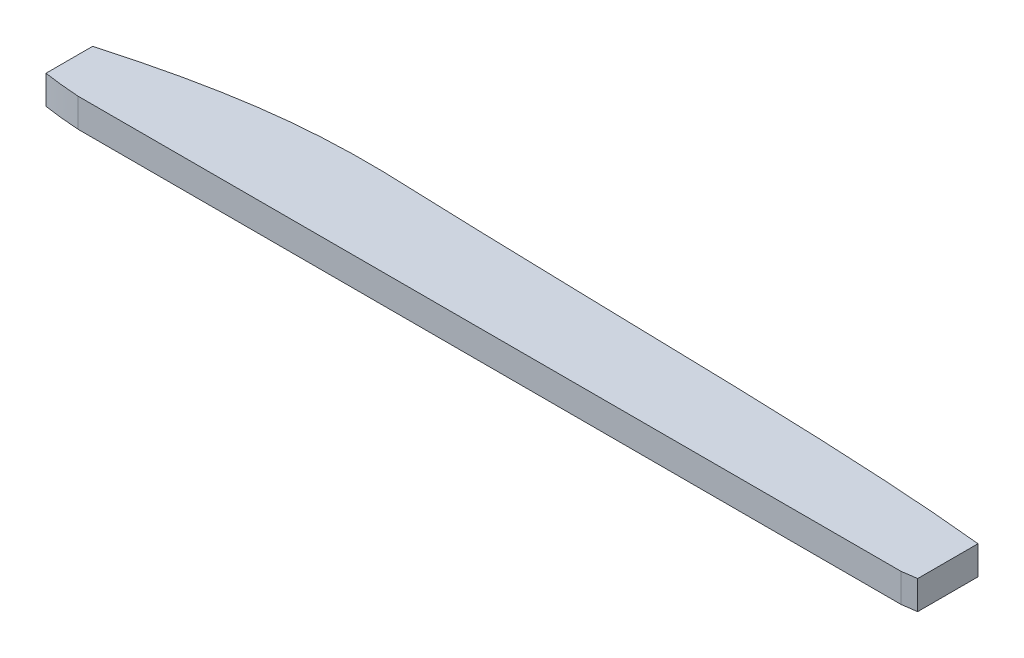
ISO-10303-21;
HEADER;
FILE_DESCRIPTION(('STEP AP214'),'2;1');
FILE_NAME('part.step','',(''),(''),'','','');
FILE_SCHEMA(('AUTOMOTIVE_DESIGN { 1 0 10303 214 1 1 1 1 }'));
ENDSEC;
DATA;
#1=APPLICATION_CONTEXT('core data for automotive mechanical design processes');
#2=APPLICATION_PROTOCOL_DEFINITION('international standard','automotive_design',2000,#1);
#3=PRODUCT_CONTEXT('',#1,'mechanical');
#4=PRODUCT('Part','Part','',(#3));
#5=PRODUCT_RELATED_PRODUCT_CATEGORY('part','',(#4));
#6=PRODUCT_DEFINITION_FORMATION('','',#4);
#7=PRODUCT_DEFINITION_CONTEXT('part definition',#1,'design');
#8=PRODUCT_DEFINITION('design','',#6,#7);
#9=PRODUCT_DEFINITION_SHAPE('','',#8);
#10=(LENGTH_UNIT() NAMED_UNIT(*) SI_UNIT(.MILLI.,.METRE.));
#11=(NAMED_UNIT(*) PLANE_ANGLE_UNIT() SI_UNIT($,.RADIAN.));
#12=(NAMED_UNIT(*) SI_UNIT($,.STERADIAN.) SOLID_ANGLE_UNIT());
#13=UNCERTAINTY_MEASURE_WITH_UNIT(LENGTH_MEASURE(1.E-05),#10,'distance_accuracy_value','');
#14=(GEOMETRIC_REPRESENTATION_CONTEXT(3) GLOBAL_UNCERTAINTY_ASSIGNED_CONTEXT((#13)) GLOBAL_UNIT_ASSIGNED_CONTEXT((#10,
#11,#12)) REPRESENTATION_CONTEXT('',''));
#15=CARTESIAN_POINT('',(0.,0.,0.));
#16=DIRECTION('',(0.,0.,1.));
#17=DIRECTION('',(1.,0.,0.));
#18=AXIS2_PLACEMENT_3D('',#15,#16,#17);
#19=CARTESIAN_POINT('',(-255.236633658495,2.921,-72.2823917229411));
#20=DIRECTION('',(0.,1.,0.));
#21=DIRECTION('',(0.,0.,1.));
#22=AXIS2_PLACEMENT_3D('',#19,#20,#21);
#23=PLANE('',#22);
#24=CARTESIAN_POINT('',(-215.715924488122,2.921,-70.4604921100144));
#25=CARTESIAN_POINT('',(-231.799642529937,2.921,-72.1495505666028));
#26=CARTESIAN_POINT('',(-256.470441338529,2.921,-72.0212095813652));
#27=CARTESIAN_POINT('',(-284.451069938425,2.921,-73.2862511205198));
#28=CARTESIAN_POINT('',(-294.871993266632,2.921,-72.023916826068));
#29=CARTESIAN_POINT('',(-304.615924488122,2.921,-69.2428463332284));
#30=B_SPLINE_CURVE_WITH_KNOTS('',3,(#24,#25,#26,#27,#28,#29),.UNSPECIFIED.,.F.,.F.,(4,1,1,4),
(0.0333418760915517,0.663885735792262,0.752110336507284,0.915587883241767),.UNSPECIFIED.);
#31=CARTESIAN_POINT('',(-215.715924488122,2.921,-70.4604921100144));
#32=VERTEX_POINT('',#31);
#33=CARTESIAN_POINT('',(-304.615924488122,2.921,-69.2428463332284));
#34=VERTEX_POINT('',#33);
#35=EDGE_CURVE('E13',#32,#34,#30,.T.);
#36=ORIENTED_EDGE('',*,*,#35,.T.);
#37=DIRECTION('',(0.,0.,1.));
#38=VECTOR('',#37,1.);
#39=CARTESIAN_POINT('',(-304.615924488122,2.921,-69.2428463332284));
#40=LINE('',#39,#38);
#41=CARTESIAN_POINT('',(-304.615924488122,2.921,-64.5009304328501));
#42=VERTEX_POINT('',#41);
#43=EDGE_CURVE('E98',#34,#42,#40,.T.);
#44=ORIENTED_EDGE('',*,*,#43,.T.);
#45=CARTESIAN_POINT('',(-304.615924488122,2.921,-64.5009304328501));
#46=CARTESIAN_POINT('',(-303.637167830755,2.921,-64.3397250195199));
#47=CARTESIAN_POINT('',(-302.448515520558,2.921,-64.2107279510173));
#48=CARTESIAN_POINT('',(-300.952638132703,2.921,-64.1104921100144));
#49=B_SPLINE_CURVE_WITH_KNOTS('',3,(#45,#46,#47,#48),.UNSPECIFIED.,.F.,.F.,(4,4),
(0.767987956880945,1.),.UNSPECIFIED.);
#50=CARTESIAN_POINT('',(-300.952638132703,2.921,-64.1104921100144));
#51=VERTEX_POINT('',#50);
#52=EDGE_CURVE('E239',#42,#51,#49,.T.);
#53=ORIENTED_EDGE('',*,*,#52,.T.);
#54=DIRECTION('',(1.,0.,0.));
#55=VECTOR('',#54,1.);
#56=CARTESIAN_POINT('',(-300.952638132703,2.921,-64.1104921100144));
#57=LINE('',#56,#55);
#58=CARTESIAN_POINT('',(-217.195795723811,2.921,-64.1104921100144));
#59=VERTEX_POINT('',#58);
#60=EDGE_CURVE('E241',#51,#59,#57,.T.);
#61=ORIENTED_EDGE('',*,*,#60,.T.);
#62=CARTESIAN_POINT('',(-217.195795723811,2.921,-64.1104921100144));
#63=CARTESIAN_POINT('',(-216.418515965877,2.921,-64.1864183337523));
#64=CARTESIAN_POINT('',(-215.715924488122,2.921,-64.3207456124465));
#65=B_SPLINE_CURVE_WITH_KNOTS('',2,(#62,#63,#64),.UNSPECIFIED.,.F.,.F.,(3,3),(0.882956557890102,
1.),.UNSPECIFIED.);
#66=CARTESIAN_POINT('',(-215.715924488122,2.921,-64.3207456124465));
#67=VERTEX_POINT('',#66);
#68=EDGE_CURVE('E236',#59,#67,#65,.T.);
#69=ORIENTED_EDGE('',*,*,#68,.T.);
#70=DIRECTION('',(0.,0.,-1.));
#71=VECTOR('',#70,1.);
#72=CARTESIAN_POINT('',(-215.715924488122,2.921,-64.3207456124465));
#73=LINE('',#72,#71);
#74=EDGE_CURVE('E231',#67,#32,#73,.T.);
#75=ORIENTED_EDGE('',*,*,#74,.T.);
#76=EDGE_LOOP('',(#36,#44,#53,#61,#69,#75));
#77=FACE_BOUND('',#76,.T.);
#78=ADVANCED_FACE('F88',(#77),#23,.T.);
#79=CARTESIAN_POINT('',(-215.715924488122,0.,-64.3207456124465));
#80=CARTESIAN_POINT('',(-216.418515965877,0.,-64.1864183337523));
#81=CARTESIAN_POINT('',(-217.195795723811,0.,-64.1104921100144));
#82=B_SPLINE_CURVE_WITH_KNOTS('',2,(#79,#80,#81),.UNSPECIFIED.,.F.,.F.,(3,3),(0.882956557890102,
1.),.UNSPECIFIED.);
#83=DIRECTION('',(0.,1.,0.));
#84=VECTOR('',#83,1.);
#85=SURFACE_OF_LINEAR_EXTRUSION('',#82,#84);
#86=ORIENTED_EDGE('',*,*,#68,.F.);
#87=DIRECTION('',(0.,1.,0.));
#88=VECTOR('',#87,1.);
#89=CARTESIAN_POINT('',(-217.195795723811,0.,-64.1104921100144));
#90=LINE('',#89,#88);
#91=CARTESIAN_POINT('',(-217.195795723811,0.,-64.1104921100144));
#92=VERTEX_POINT('',#91);
#93=EDGE_CURVE('E229',#92,#59,#90,.T.);
#94=ORIENTED_EDGE('',*,*,#93,.F.);
#95=CARTESIAN_POINT('',(-215.715924488122,0.,-64.3207456124465));
#96=VERTEX_POINT('',#95);
#97=EDGE_CURVE('E106',#96,#92,#82,.T.);
#98=ORIENTED_EDGE('',*,*,#97,.F.);
#99=DIRECTION('',(0.,1.,0.));
#100=VECTOR('',#99,1.);
#101=CARTESIAN_POINT('',(-215.715924488122,0.,-64.3207456124465));
#102=LINE('',#101,#100);
#103=EDGE_CURVE('E210',#96,#67,#102,.T.);
#104=ORIENTED_EDGE('',*,*,#103,.T.);
#105=EDGE_LOOP('',(#86,#94,#98,#104));
#106=FACE_BOUND('',#105,.T.);
#107=ADVANCED_FACE('F199',(#106),#85,.F.);
#108=CARTESIAN_POINT('',(0.,0.,-64.1104921100144));
#109=DIRECTION('',(0.,0.,1.));
#110=DIRECTION('',(1.,0.,0.));
#111=AXIS2_PLACEMENT_3D('',#108,#109,#110);
#112=PLANE('',#111);
#113=DIRECTION('',(0.,1.,0.));
#114=VECTOR('',#113,1.);
#115=CARTESIAN_POINT('',(-300.952638132703,0.,-64.1104921100144));
#116=LINE('',#115,#114);
#117=CARTESIAN_POINT('',(-300.952638132703,0.,-64.1104921100144));
#118=VERTEX_POINT('',#117);
#119=EDGE_CURVE('E224',#118,#51,#116,.T.);
#120=ORIENTED_EDGE('',*,*,#119,.F.);
#121=DIRECTION('',(1.,0.,0.));
#122=VECTOR('',#121,1.);
#123=CARTESIAN_POINT('',(0.,0.,-64.1104921100144));
#124=LINE('',#123,#122);
#125=EDGE_CURVE('E171',#118,#92,#124,.T.);
#126=ORIENTED_EDGE('',*,*,#125,.T.);
#127=ORIENTED_EDGE('',*,*,#93,.T.);
#128=ORIENTED_EDGE('',*,*,#60,.F.);
#129=EDGE_LOOP('',(#120,#126,#127,#128));
#130=FACE_BOUND('',#129,.T.);
#131=ADVANCED_FACE('F190',(#130),#112,.T.);
#132=CARTESIAN_POINT('',(-304.615924488122,0.,-64.5009304328501));
#133=CARTESIAN_POINT('',(-303.637167830755,0.,-64.3397250195199));
#134=CARTESIAN_POINT('',(-302.448515520558,0.,-64.2107279510173));
#135=CARTESIAN_POINT('',(-300.952638132703,0.,-64.1104921100144));
#136=B_SPLINE_CURVE_WITH_KNOTS('',3,(#132,#133,#134,#135),.UNSPECIFIED.,.F.,.F.,(4,4),
(0.767987956880945,1.),.UNSPECIFIED.);
#137=DIRECTION('',(0.,1.,0.));
#138=VECTOR('',#137,1.);
#139=SURFACE_OF_LINEAR_EXTRUSION('',#136,#138);
#140=DIRECTION('',(0.,1.,0.));
#141=VECTOR('',#140,1.);
#142=CARTESIAN_POINT('',(-304.615924488122,0.,-64.5009304328501));
#143=LINE('',#142,#141);
#144=CARTESIAN_POINT('',(-304.615924488122,0.,-64.5009304328501));
#145=VERTEX_POINT('',#144);
#146=EDGE_CURVE('E155',#145,#42,#143,.T.);
#147=ORIENTED_EDGE('',*,*,#146,.F.);
#148=EDGE_CURVE('E167',#145,#118,#136,.T.);
#149=ORIENTED_EDGE('',*,*,#148,.T.);
#150=ORIENTED_EDGE('',*,*,#119,.T.);
#151=ORIENTED_EDGE('',*,*,#52,.F.);
#152=EDGE_LOOP('',(#147,#149,#150,#151));
#153=FACE_BOUND('',#152,.T.);
#154=ADVANCED_FACE('F186',(#153),#139,.T.);
#155=CARTESIAN_POINT('',(-304.615924488122,0.,0.));
#156=DIRECTION('',(-1.,0.,0.));
#157=DIRECTION('',(0.,0.,1.));
#158=AXIS2_PLACEMENT_3D('',#155,#156,#157);
#159=PLANE('',#158);
#160=DIRECTION('',(0.,1.,0.));
#161=VECTOR('',#160,1.);
#162=CARTESIAN_POINT('',(-304.615924488122,0.,-69.2428463332284));
#163=LINE('',#162,#161);
#164=CARTESIAN_POINT('',(-304.615924488122,0.,-69.2428463332284));
#165=VERTEX_POINT('',#164);
#166=EDGE_CURVE('E145',#165,#34,#163,.T.);
#167=ORIENTED_EDGE('',*,*,#166,.F.);
#168=DIRECTION('',(0.,0.,1.));
#169=VECTOR('',#168,1.);
#170=CARTESIAN_POINT('',(-304.615924488122,0.,0.));
#171=LINE('',#170,#169);
#172=EDGE_CURVE('E150',#165,#145,#171,.T.);
#173=ORIENTED_EDGE('',*,*,#172,.T.);
#174=ORIENTED_EDGE('',*,*,#146,.T.);
#175=ORIENTED_EDGE('',*,*,#43,.F.);
#176=EDGE_LOOP('',(#167,#173,#174,#175));
#177=FACE_BOUND('',#176,.T.);
#178=ADVANCED_FACE('F147',(#177),#159,.T.);
#179=CARTESIAN_POINT('',(-304.615924488122,0.,-69.2428463332284));
#180=CARTESIAN_POINT('',(-294.871993266632,0.,-72.023916826068));
#181=CARTESIAN_POINT('',(-284.451069938425,0.,-73.2862511205198));
#182=CARTESIAN_POINT('',(-256.470441338529,0.,-72.0212095813652));
#183=CARTESIAN_POINT('',(-231.799642529937,0.,-72.1495505666028));
#184=CARTESIAN_POINT('',(-215.715924488122,0.,-70.4604921100144));
#185=B_SPLINE_CURVE_WITH_KNOTS('',3,(#179,#180,#181,#182,#183,#184),.UNSPECIFIED.,.F.,.F.,(4,1,
1,4),(0.0333418760915517,0.196819422826035,0.285044023541057,0.915587883241767),.UNSPECIFIED.);
#186=DIRECTION('',(0.,1.,0.));
#187=VECTOR('',#186,1.);
#188=SURFACE_OF_LINEAR_EXTRUSION('',#185,#187);
#189=ORIENTED_EDGE('',*,*,#35,.F.);
#190=DIRECTION('',(0.,1.,0.));
#191=VECTOR('',#190,1.);
#192=CARTESIAN_POINT('',(-215.715924488122,0.,-70.4604921100144));
#193=LINE('',#192,#191);
#194=CARTESIAN_POINT('',(-215.715924488122,0.,-70.4604921100144));
#195=VERTEX_POINT('',#194);
#196=EDGE_CURVE('E114',#195,#32,#193,.T.);
#197=ORIENTED_EDGE('',*,*,#196,.F.);
#198=EDGE_CURVE('E158',#165,#195,#185,.T.);
#199=ORIENTED_EDGE('',*,*,#198,.F.);
#200=ORIENTED_EDGE('',*,*,#166,.T.);
#201=EDGE_LOOP('',(#189,#197,#199,#200));
#202=FACE_BOUND('',#201,.T.);
#203=ADVANCED_FACE('F159',(#202),#188,.F.);
#204=CARTESIAN_POINT('',(-215.715924488122,0.,0.));
#205=DIRECTION('',(1.,0.,0.));
#206=DIRECTION('',(0.,0.,-1.));
#207=AXIS2_PLACEMENT_3D('',#204,#205,#206);
#208=PLANE('',#207);
#209=ORIENTED_EDGE('',*,*,#103,.F.);
#210=DIRECTION('',(0.,0.,-1.));
#211=VECTOR('',#210,1.);
#212=CARTESIAN_POINT('',(-215.715924488122,0.,0.));
#213=LINE('',#212,#211);
#214=EDGE_CURVE('E163',#96,#195,#213,.T.);
#215=ORIENTED_EDGE('',*,*,#214,.T.);
#216=ORIENTED_EDGE('',*,*,#196,.T.);
#217=ORIENTED_EDGE('',*,*,#74,.F.);
#218=EDGE_LOOP('',(#209,#215,#216,#217));
#219=FACE_BOUND('',#218,.T.);
#220=ADVANCED_FACE('F196',(#219),#208,.T.);
#221=CARTESIAN_POINT('',(0.,0.,0.));
#222=DIRECTION('',(0.,1.,0.));
#223=DIRECTION('',(0.,0.,1.));
#224=AXIS2_PLACEMENT_3D('',#221,#222,#223);
#225=PLANE('',#224);
#226=ORIENTED_EDGE('',*,*,#214,.F.);
#227=ORIENTED_EDGE('',*,*,#97,.T.);
#228=ORIENTED_EDGE('',*,*,#125,.F.);
#229=ORIENTED_EDGE('',*,*,#148,.F.);
#230=ORIENTED_EDGE('',*,*,#172,.F.);
#231=ORIENTED_EDGE('',*,*,#198,.T.);
#232=EDGE_LOOP('',(#226,#227,#228,#229,#230,#231));
#233=FACE_BOUND('',#232,.T.);
#234=ADVANCED_FACE('F90',(#233),#225,.F.);
#235=CLOSED_SHELL('',(#78,#107,#131,#154,#178,#203,#220,#234));
#236=MANIFOLD_SOLID_BREP('B2',#235);
#237=ADVANCED_BREP_SHAPE_REPRESENTATION('',(#18,#236),#14);
#238=SHAPE_DEFINITION_REPRESENTATION(#9,#237);
ENDSEC;
END-ISO-10303-21;
